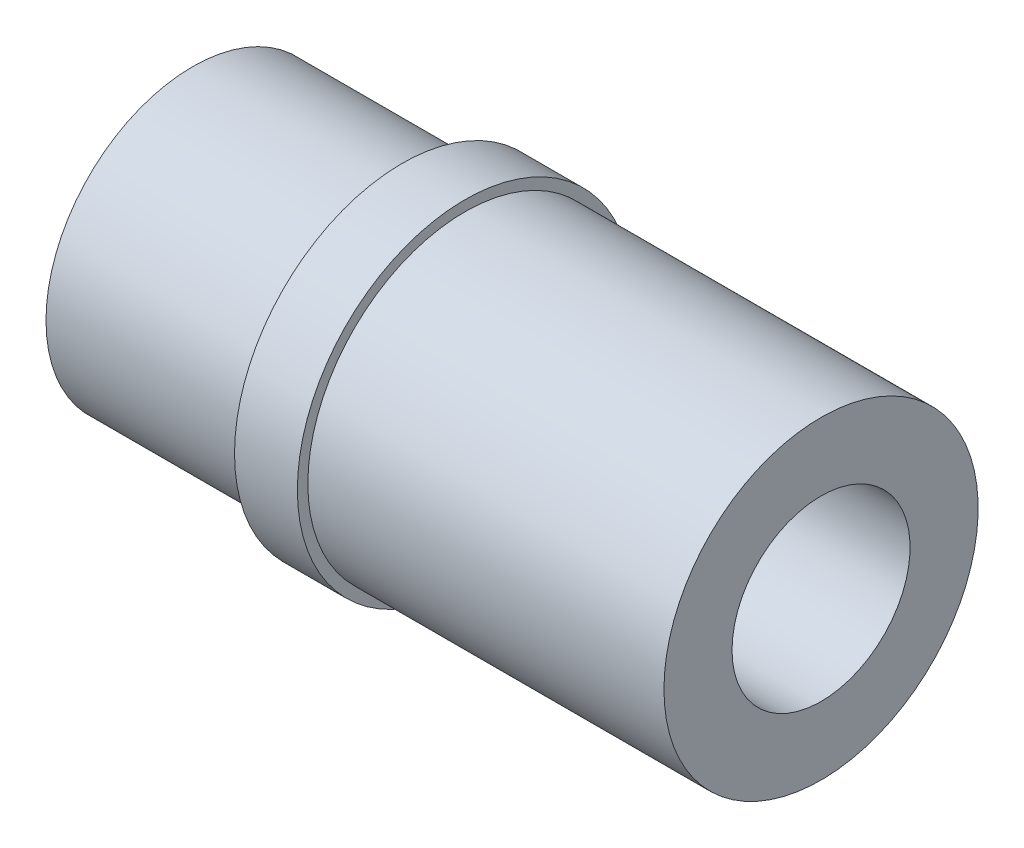
ISO-10303-21;
HEADER;
FILE_DESCRIPTION(('STEP AP214'),'2;1');
FILE_NAME('part.step','',(''),(''),'','','');
FILE_SCHEMA(('AUTOMOTIVE_DESIGN { 1 0 10303 214 1 1 1 1 }'));
ENDSEC;
DATA;
#1=APPLICATION_CONTEXT('core data for automotive mechanical design processes');
#2=APPLICATION_PROTOCOL_DEFINITION('international standard','automotive_design',2000,#1);
#3=PRODUCT_CONTEXT('',#1,'mechanical');
#4=PRODUCT('Part','Part','',(#3));
#5=PRODUCT_RELATED_PRODUCT_CATEGORY('part','',(#4));
#6=PRODUCT_DEFINITION_FORMATION('','',#4);
#7=PRODUCT_DEFINITION_CONTEXT('part definition',#1,'design');
#8=PRODUCT_DEFINITION('design','',#6,#7);
#9=PRODUCT_DEFINITION_SHAPE('','',#8);
#10=(LENGTH_UNIT() NAMED_UNIT(*) SI_UNIT(.MILLI.,.METRE.));
#11=(NAMED_UNIT(*) PLANE_ANGLE_UNIT() SI_UNIT($,.RADIAN.));
#12=(NAMED_UNIT(*) SI_UNIT($,.STERADIAN.) SOLID_ANGLE_UNIT());
#13=UNCERTAINTY_MEASURE_WITH_UNIT(LENGTH_MEASURE(1.E-05),#10,'distance_accuracy_value','');
#14=(GEOMETRIC_REPRESENTATION_CONTEXT(3) GLOBAL_UNCERTAINTY_ASSIGNED_CONTEXT((#13)) GLOBAL_UNIT_ASSIGNED_CONTEXT((#10,
#11,#12)) REPRESENTATION_CONTEXT('',''));
#15=CARTESIAN_POINT('',(0.,0.,0.));
#16=DIRECTION('',(0.,0.,1.));
#17=DIRECTION('',(1.,0.,0.));
#18=AXIS2_PLACEMENT_3D('',#15,#16,#17);
#19=CARTESIAN_POINT('',(0.,7.5,0.));
#20=DIRECTION('',(-1.,0.,0.));
#21=DIRECTION('',(0.,0.,1.));
#22=AXIS2_PLACEMENT_3D('',#19,#20,#21);
#23=PLANE('',#22);
#24=CARTESIAN_POINT('',(0.,0.,0.));
#25=DIRECTION('',(-1.,0.,0.));
#26=DIRECTION('',(0.,0.,1.));
#27=AXIS2_PLACEMENT_3D('',#24,#25,#26);
#28=CIRCLE('',#27,7.5);
#29=CARTESIAN_POINT('',(0.,0.,7.5));
#30=VERTEX_POINT('',#29);
#31=EDGE_CURVE('E82',#30,#30,#28,.T.);
#32=ORIENTED_EDGE('',*,*,#31,.F.);
#33=EDGE_LOOP('',(#32));
#34=FACE_BOUND('',#33,.T.);
#35=CARTESIAN_POINT('',(0.,0.,0.));
#36=DIRECTION('',(-1.,0.,0.));
#37=DIRECTION('',(0.,0.,1.));
#38=AXIS2_PLACEMENT_3D('',#35,#36,#37);
#39=CIRCLE('',#38,4.25);
#40=CARTESIAN_POINT('',(0.,0.,4.25));
#41=VERTEX_POINT('',#40);
#42=EDGE_CURVE('E10',#41,#41,#39,.T.);
#43=ORIENTED_EDGE('',*,*,#42,.T.);
#44=EDGE_LOOP('',(#43));
#45=FACE_BOUND('',#44,.T.);
#46=ADVANCED_FACE('F43',(#34,#45),#23,.F.);
#47=CARTESIAN_POINT('',(-108.783752644412,0.,0.));
#48=DIRECTION('',(-1.,0.,0.));
#49=DIRECTION('',(0.,0.,1.));
#50=AXIS2_PLACEMENT_3D('',#47,#48,#49);
#51=CYLINDRICAL_SURFACE('',#50,4.25);
#52=ORIENTED_EDGE('',*,*,#42,.F.);
#53=EDGE_LOOP('',(#52));
#54=FACE_BOUND('',#53,.T.);
#55=CARTESIAN_POINT('',(-21.1057878470193,0.,0.));
#56=DIRECTION('',(-1.,0.,0.));
#57=DIRECTION('',(0.,0.,1.));
#58=AXIS2_PLACEMENT_3D('',#55,#56,#57);
#59=CIRCLE('',#58,4.25);
#60=CARTESIAN_POINT('',(-21.1057878470193,0.,4.25));
#61=VERTEX_POINT('',#60);
#62=EDGE_CURVE('E50',#61,#61,#59,.T.);
#63=ORIENTED_EDGE('',*,*,#62,.T.);
#64=EDGE_LOOP('',(#63));
#65=FACE_BOUND('',#64,.T.);
#66=ADVANCED_FACE('F90',(#54,#65),#51,.F.);
#67=CARTESIAN_POINT('',(-30.,0.,0.));
#68=DIRECTION('',(-1.,0.,0.));
#69=DIRECTION('',(0.,0.,1.));
#70=AXIS2_PLACEMENT_3D('',#67,#68,#69);
#71=CONICAL_SURFACE('',#70,5.5,0.139626340159539);
#72=ORIENTED_EDGE('',*,*,#62,.F.);
#73=EDGE_LOOP('',(#72));
#74=FACE_BOUND('',#73,.T.);
#75=CARTESIAN_POINT('',(-30.,0.,0.));
#76=DIRECTION('',(-1.,0.,0.));
#77=DIRECTION('',(0.,0.,1.));
#78=AXIS2_PLACEMENT_3D('',#75,#76,#77);
#79=CIRCLE('',#78,5.5);
#80=CARTESIAN_POINT('',(-30.,0.,5.5));
#81=VERTEX_POINT('',#80);
#82=EDGE_CURVE('E55',#81,#81,#79,.T.);
#83=ORIENTED_EDGE('',*,*,#82,.T.);
#84=EDGE_LOOP('',(#83));
#85=FACE_BOUND('',#84,.T.);
#86=ADVANCED_FACE('F94',(#74,#85),#71,.F.);
#87=CARTESIAN_POINT('',(-30.,5.5,0.));
#88=DIRECTION('',(1.,0.,0.));
#89=DIRECTION('',(0.,0.,-1.));
#90=AXIS2_PLACEMENT_3D('',#87,#88,#89);
#91=PLANE('',#90);
#92=ORIENTED_EDGE('',*,*,#82,.F.);
#93=EDGE_LOOP('',(#92));
#94=FACE_BOUND('',#93,.T.);
#95=CARTESIAN_POINT('',(-30.,0.,0.));
#96=DIRECTION('',(-1.,0.,0.));
#97=DIRECTION('',(0.,0.,1.));
#98=AXIS2_PLACEMENT_3D('',#95,#96,#97);
#99=CIRCLE('',#98,7.);
#100=CARTESIAN_POINT('',(-30.,0.,7.));
#101=VERTEX_POINT('',#100);
#102=EDGE_CURVE('E60',#101,#101,#99,.T.);
#103=ORIENTED_EDGE('',*,*,#102,.T.);
#104=EDGE_LOOP('',(#103));
#105=FACE_BOUND('',#104,.T.);
#106=ADVANCED_FACE('F99',(#94,#105),#91,.F.);
#107=CARTESIAN_POINT('',(-108.783752644412,0.,0.));
#108=DIRECTION('',(-1.,0.,0.));
#109=DIRECTION('',(0.,0.,1.));
#110=AXIS2_PLACEMENT_3D('',#107,#108,#109);
#111=CYLINDRICAL_SURFACE('',#110,7.);
#112=ORIENTED_EDGE('',*,*,#102,.F.);
#113=EDGE_LOOP('',(#112));
#114=FACE_BOUND('',#113,.T.);
#115=CARTESIAN_POINT('',(-20.,0.,0.));
#116=DIRECTION('',(-1.,0.,0.));
#117=DIRECTION('',(0.,0.,1.));
#118=AXIS2_PLACEMENT_3D('',#115,#116,#117);
#119=CIRCLE('',#118,7.);
#120=CARTESIAN_POINT('',(-20.,0.,7.));
#121=VERTEX_POINT('',#120);
#122=EDGE_CURVE('E66',#121,#121,#119,.T.);
#123=ORIENTED_EDGE('',*,*,#122,.T.);
#124=EDGE_LOOP('',(#123));
#125=FACE_BOUND('',#124,.T.);
#126=ADVANCED_FACE('F105',(#114,#125),#111,.T.);
#127=CARTESIAN_POINT('',(-20.,8.,0.));
#128=DIRECTION('',(1.,0.,0.));
#129=DIRECTION('',(0.,0.,-1.));
#130=AXIS2_PLACEMENT_3D('',#127,#128,#129);
#131=PLANE('',#130);
#132=ORIENTED_EDGE('',*,*,#122,.F.);
#133=EDGE_LOOP('',(#132));
#134=FACE_BOUND('',#133,.T.);
#135=CARTESIAN_POINT('',(-20.,0.,0.));
#136=DIRECTION('',(-1.,0.,0.));
#137=DIRECTION('',(0.,0.,1.));
#138=AXIS2_PLACEMENT_3D('',#135,#136,#137);
#139=CIRCLE('',#138,8.);
#140=CARTESIAN_POINT('',(-20.,0.,8.));
#141=VERTEX_POINT('',#140);
#142=EDGE_CURVE('E70',#141,#141,#139,.T.);
#143=ORIENTED_EDGE('',*,*,#142,.T.);
#144=EDGE_LOOP('',(#143));
#145=FACE_BOUND('',#144,.T.);
#146=ADVANCED_FACE('F109',(#134,#145),#131,.F.);
#147=CARTESIAN_POINT('',(-108.783752644412,0.,0.));
#148=DIRECTION('',(-1.,0.,0.));
#149=DIRECTION('',(0.,0.,1.));
#150=AXIS2_PLACEMENT_3D('',#147,#148,#149);
#151=CYLINDRICAL_SURFACE('',#150,8.);
#152=ORIENTED_EDGE('',*,*,#142,.F.);
#153=EDGE_LOOP('',(#152));
#154=FACE_BOUND('',#153,.T.);
#155=CARTESIAN_POINT('',(-17.,0.,0.));
#156=DIRECTION('',(-1.,0.,0.));
#157=DIRECTION('',(0.,0.,1.));
#158=AXIS2_PLACEMENT_3D('',#155,#156,#157);
#159=CIRCLE('',#158,8.);
#160=CARTESIAN_POINT('',(-17.,0.,8.));
#161=VERTEX_POINT('',#160);
#162=EDGE_CURVE('E74',#161,#161,#159,.T.);
#163=ORIENTED_EDGE('',*,*,#162,.T.);
#164=EDGE_LOOP('',(#163));
#165=FACE_BOUND('',#164,.T.);
#166=ADVANCED_FACE('F113',(#154,#165),#151,.T.);
#167=CARTESIAN_POINT('',(-17.,7.5,0.));
#168=DIRECTION('',(-1.,0.,0.));
#169=DIRECTION('',(0.,0.,1.));
#170=AXIS2_PLACEMENT_3D('',#167,#168,#169);
#171=PLANE('',#170);
#172=ORIENTED_EDGE('',*,*,#162,.F.);
#173=EDGE_LOOP('',(#172));
#174=FACE_BOUND('',#173,.T.);
#175=CARTESIAN_POINT('',(-17.,0.,0.));
#176=DIRECTION('',(-1.,0.,0.));
#177=DIRECTION('',(0.,0.,1.));
#178=AXIS2_PLACEMENT_3D('',#175,#176,#177);
#179=CIRCLE('',#178,7.5);
#180=CARTESIAN_POINT('',(-17.,0.,7.5));
#181=VERTEX_POINT('',#180);
#182=EDGE_CURVE('E78',#181,#181,#179,.T.);
#183=ORIENTED_EDGE('',*,*,#182,.T.);
#184=EDGE_LOOP('',(#183));
#185=FACE_BOUND('',#184,.T.);
#186=ADVANCED_FACE('F117',(#174,#185),#171,.F.);
#187=CARTESIAN_POINT('',(-108.783752644412,0.,0.));
#188=DIRECTION('',(-1.,0.,0.));
#189=DIRECTION('',(0.,0.,1.));
#190=AXIS2_PLACEMENT_3D('',#187,#188,#189);
#191=CYLINDRICAL_SURFACE('',#190,7.5);
#192=ORIENTED_EDGE('',*,*,#182,.F.);
#193=EDGE_LOOP('',(#192));
#194=FACE_BOUND('',#193,.T.);
#195=ORIENTED_EDGE('',*,*,#31,.T.);
#196=EDGE_LOOP('',(#195));
#197=FACE_BOUND('',#196,.T.);
#198=ADVANCED_FACE('F87',(#194,#197),#191,.T.);
#199=CLOSED_SHELL('',(#46,#66,#86,#106,#126,#146,#166,#186,#198));
#200=MANIFOLD_SOLID_BREP('B2',#199);
#201=ADVANCED_BREP_SHAPE_REPRESENTATION('',(#18,#200),#14);
#202=SHAPE_DEFINITION_REPRESENTATION(#9,#201);
ENDSEC;
END-ISO-10303-21;
